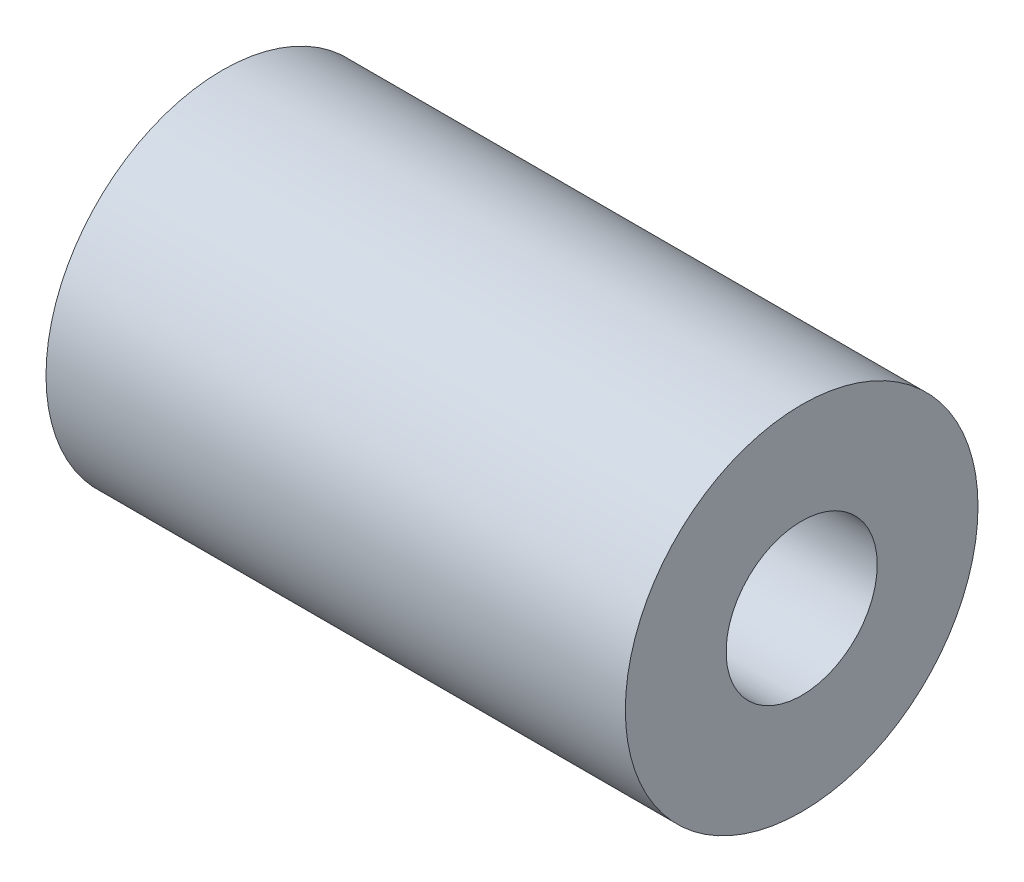
ISO-10303-21;
HEADER;
FILE_DESCRIPTION(('STEP AP214'),'2;1');
FILE_NAME('part.step','',(''),(''),'','','');
FILE_SCHEMA(('AUTOMOTIVE_DESIGN { 1 0 10303 214 1 1 1 1 }'));
ENDSEC;
DATA;
#1=APPLICATION_CONTEXT('core data for automotive mechanical design processes');
#2=APPLICATION_PROTOCOL_DEFINITION('international standard','automotive_design',2000,#1);
#3=PRODUCT_CONTEXT('',#1,'mechanical');
#4=PRODUCT('Part','Part','',(#3));
#5=PRODUCT_RELATED_PRODUCT_CATEGORY('part','',(#4));
#6=PRODUCT_DEFINITION_FORMATION('','',#4);
#7=PRODUCT_DEFINITION_CONTEXT('part definition',#1,'design');
#8=PRODUCT_DEFINITION('design','',#6,#7);
#9=PRODUCT_DEFINITION_SHAPE('','',#8);
#10=(LENGTH_UNIT() NAMED_UNIT(*) SI_UNIT(.MILLI.,.METRE.));
#11=(NAMED_UNIT(*) PLANE_ANGLE_UNIT() SI_UNIT($,.RADIAN.));
#12=(NAMED_UNIT(*) SI_UNIT($,.STERADIAN.) SOLID_ANGLE_UNIT());
#13=UNCERTAINTY_MEASURE_WITH_UNIT(LENGTH_MEASURE(1.E-05),#10,'distance_accuracy_value','');
#14=(GEOMETRIC_REPRESENTATION_CONTEXT(3) GLOBAL_UNCERTAINTY_ASSIGNED_CONTEXT((#13)) GLOBAL_UNIT_ASSIGNED_CONTEXT((#10,
#11,#12)) REPRESENTATION_CONTEXT('',''));
#15=CARTESIAN_POINT('',(0.,0.,0.));
#16=DIRECTION('',(0.,0.,1.));
#17=DIRECTION('',(1.,0.,0.));
#18=AXIS2_PLACEMENT_3D('',#15,#16,#17);
#19=CARTESIAN_POINT('',(11.5,0.,0.));
#20=DIRECTION('',(1.,0.,0.));
#21=DIRECTION('',(0.,0.,-1.));
#22=AXIS2_PLACEMENT_3D('',#19,#20,#21);
#23=PLANE('',#22);
#24=CARTESIAN_POINT('',(11.5,0.,0.));
#25=DIRECTION('',(1.,0.,0.));
#26=DIRECTION('',(0.,0.,-1.));
#27=AXIS2_PLACEMENT_3D('',#24,#25,#26);
#28=CIRCLE('',#27,3.5);
#29=CARTESIAN_POINT('',(11.5,0.,-3.5));
#30=VERTEX_POINT('',#29);
#31=EDGE_CURVE('E10',#30,#30,#28,.T.);
#32=ORIENTED_EDGE('',*,*,#31,.T.);
#33=EDGE_LOOP('',(#32));
#34=FACE_BOUND('',#33,.T.);
#35=CARTESIAN_POINT('',(11.5,0.,0.));
#36=DIRECTION('',(1.,0.,0.));
#37=DIRECTION('',(0.,0.,-1.));
#38=AXIS2_PLACEMENT_3D('',#35,#36,#37);
#39=CIRCLE('',#38,1.5);
#40=CARTESIAN_POINT('',(11.5,0.,-1.5));
#41=VERTEX_POINT('',#40);
#42=EDGE_CURVE('E44',#41,#41,#39,.T.);
#43=ORIENTED_EDGE('',*,*,#42,.F.);
#44=EDGE_LOOP('',(#43));
#45=FACE_BOUND('',#44,.T.);
#46=ADVANCED_FACE('F33',(#34,#45),#23,.T.);
#47=CARTESIAN_POINT('',(0.,0.,0.));
#48=DIRECTION('',(1.,0.,0.));
#49=DIRECTION('',(0.,0.,-1.));
#50=AXIS2_PLACEMENT_3D('',#47,#48,#49);
#51=PLANE('',#50);
#52=CARTESIAN_POINT('',(0.,0.,0.));
#53=DIRECTION('',(1.,0.,0.));
#54=DIRECTION('',(0.,0.,-1.));
#55=AXIS2_PLACEMENT_3D('',#52,#53,#54);
#56=CIRCLE('',#55,3.5);
#57=CARTESIAN_POINT('',(0.,0.,-3.5));
#58=VERTEX_POINT('',#57);
#59=EDGE_CURVE('E37',#58,#58,#56,.T.);
#60=ORIENTED_EDGE('',*,*,#59,.F.);
#61=EDGE_LOOP('',(#60));
#62=FACE_BOUND('',#61,.T.);
#63=CARTESIAN_POINT('',(0.,0.,0.));
#64=DIRECTION('',(1.,0.,0.));
#65=DIRECTION('',(0.,0.,-1.));
#66=AXIS2_PLACEMENT_3D('',#63,#64,#65);
#67=CIRCLE('',#66,1.5);
#68=CARTESIAN_POINT('',(0.,0.,-1.5));
#69=VERTEX_POINT('',#68);
#70=EDGE_CURVE('E46',#69,#69,#67,.T.);
#71=ORIENTED_EDGE('',*,*,#70,.T.);
#72=EDGE_LOOP('',(#71));
#73=FACE_BOUND('',#72,.T.);
#74=ADVANCED_FACE('F56',(#62,#73),#51,.F.);
#75=CARTESIAN_POINT('',(11.5,0.,0.));
#76=DIRECTION('',(-1.,0.,0.));
#77=DIRECTION('',(0.,0.,1.));
#78=AXIS2_PLACEMENT_3D('',#75,#76,#77);
#79=CYLINDRICAL_SURFACE('',#78,3.5);
#80=ORIENTED_EDGE('',*,*,#31,.F.);
#81=EDGE_LOOP('',(#80));
#82=FACE_BOUND('',#81,.T.);
#83=ORIENTED_EDGE('',*,*,#59,.T.);
#84=EDGE_LOOP('',(#83));
#85=FACE_BOUND('',#84,.T.);
#86=ADVANCED_FACE('F35',(#82,#85),#79,.T.);
#87=CARTESIAN_POINT('',(11.5,0.,0.));
#88=DIRECTION('',(-1.,0.,0.));
#89=DIRECTION('',(0.,0.,1.));
#90=AXIS2_PLACEMENT_3D('',#87,#88,#89);
#91=CYLINDRICAL_SURFACE('',#90,1.5);
#92=ORIENTED_EDGE('',*,*,#42,.T.);
#93=EDGE_LOOP('',(#92));
#94=FACE_BOUND('',#93,.T.);
#95=ORIENTED_EDGE('',*,*,#70,.F.);
#96=EDGE_LOOP('',(#95));
#97=FACE_BOUND('',#96,.T.);
#98=ADVANCED_FACE('F52',(#94,#97),#91,.F.);
#99=CLOSED_SHELL('',(#46,#74,#86,#98));
#100=MANIFOLD_SOLID_BREP('B2',#99);
#101=ADVANCED_BREP_SHAPE_REPRESENTATION('',(#18,#100),#14);
#102=SHAPE_DEFINITION_REPRESENTATION(#9,#101);
ENDSEC;
END-ISO-10303-21;
